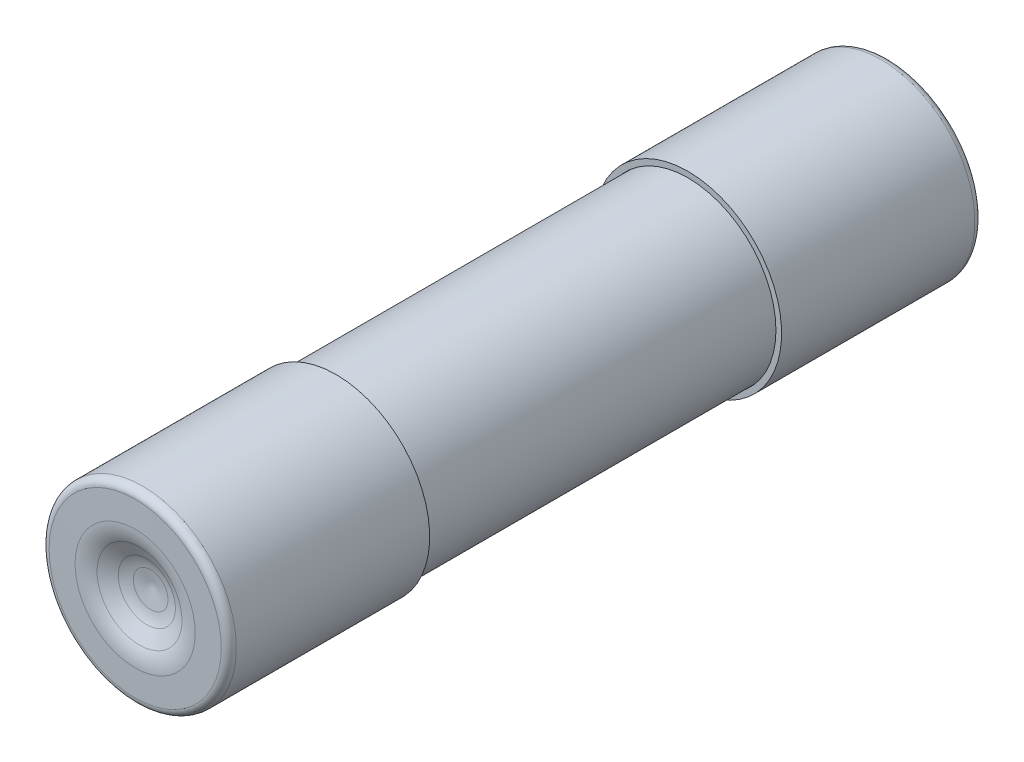
ISO-10303-21;
HEADER;
FILE_DESCRIPTION(('STEP AP214'),'2;1');
FILE_NAME('part.step','',(''),(''),'','','');
FILE_SCHEMA(('AUTOMOTIVE_DESIGN { 1 0 10303 214 1 1 1 1 }'));
ENDSEC;
DATA;
#1=APPLICATION_CONTEXT('core data for automotive mechanical design processes');
#2=APPLICATION_PROTOCOL_DEFINITION('international standard','automotive_design',2000,#1);
#3=PRODUCT_CONTEXT('',#1,'mechanical');
#4=PRODUCT('Part','Part','',(#3));
#5=PRODUCT_RELATED_PRODUCT_CATEGORY('part','',(#4));
#6=PRODUCT_DEFINITION_FORMATION('','',#4);
#7=PRODUCT_DEFINITION_CONTEXT('part definition',#1,'design');
#8=PRODUCT_DEFINITION('design','',#6,#7);
#9=PRODUCT_DEFINITION_SHAPE('','',#8);
#10=(LENGTH_UNIT() NAMED_UNIT(*) SI_UNIT(.MILLI.,.METRE.));
#11=(NAMED_UNIT(*) PLANE_ANGLE_UNIT() SI_UNIT($,.RADIAN.));
#12=(NAMED_UNIT(*) SI_UNIT($,.STERADIAN.) SOLID_ANGLE_UNIT());
#13=UNCERTAINTY_MEASURE_WITH_UNIT(LENGTH_MEASURE(1.E-05),#10,'distance_accuracy_value','');
#14=(GEOMETRIC_REPRESENTATION_CONTEXT(3) GLOBAL_UNCERTAINTY_ASSIGNED_CONTEXT((#13)) GLOBAL_UNIT_ASSIGNED_CONTEXT((#10,
#11,#12)) REPRESENTATION_CONTEXT('',''));
#15=CARTESIAN_POINT('',(0.,0.,0.));
#16=DIRECTION('',(0.,0.,1.));
#17=DIRECTION('',(1.,0.,0.));
#18=AXIS2_PLACEMENT_3D('',#15,#16,#17);
#19=CARTESIAN_POINT('',(0.,0.,19.3801475961462));
#20=DIRECTION('',(0.,0.,1.));
#21=DIRECTION('',(0.,-1.,0.));
#22=AXIS2_PLACEMENT_3D('',#19,#20,#21);
#23=DEGENERATE_TOROIDAL_SURFACE('',#22,0.0349351201433466,1.,.T.);
#24=CARTESIAN_POINT('',(0.,0.,18.3943292370881));
#25=DIRECTION('',(0.,0.,1.));
#26=DIRECTION('',(0.,-1.,0.));
#27=AXIS2_PLACEMENT_3D('',#24,#25,#26);
#28=CIRCLE('',#27,0.202750980371087);
#29=CARTESIAN_POINT('',(0.,-0.202750980371087,18.3943292370881));
#30=VERTEX_POINT('',#29);
#31=EDGE_CURVE('E12',#30,#30,#28,.T.);
#32=ORIENTED_EDGE('',*,*,#31,.F.);
#33=EDGE_LOOP('',(#32));
#34=FACE_BOUND('',#33,.T.);
#35=CARTESIAN_POINT('',(0.,0.,18.3801475961462));
#36=DIRECTION('',(0.,0.,1.));
#37=DIRECTION('',(0.,-1.,0.));
#38=AXIS2_PLACEMENT_3D('',#35,#36,#37);
#39=CIRCLE('',#38,0.0349351201433437);
#40=CARTESIAN_POINT('',(0.,-0.0349351201433436,18.3801475961462));
#41=VERTEX_POINT('',#40);
#42=EDGE_CURVE('E63',#41,#41,#39,.T.);
#43=ORIENTED_EDGE('',*,*,#42,.T.);
#44=EDGE_LOOP('',(#43));
#45=FACE_BOUND('',#44,.T.);
#46=ADVANCED_FACE('F43',(#34,#45),#23,.T.);
#47=CARTESIAN_POINT('',(0.,0.,18.3943292370881));
#48=DIRECTION('',(0.,0.,1.));
#49=DIRECTION('',(0.,-1.,0.));
#50=AXIS2_PLACEMENT_3D('',#47,#48,#49);
#51=CONICAL_SURFACE('',#50,0.202750980371087,1.40218263749149);
#52=CARTESIAN_POINT('',(0.,0.,18.4463330154933));
#53=DIRECTION('',(0.,0.,1.));
#54=DIRECTION('',(0.,-1.,0.));
#55=AXIS2_PLACEMENT_3D('',#52,#53,#54);
#56=CIRCLE('',#55,0.508242245753945);
#57=CARTESIAN_POINT('',(0.,-0.508242245753945,18.4463330154933));
#58=VERTEX_POINT('',#57);
#59=EDGE_CURVE('E49',#58,#58,#56,.T.);
#60=ORIENTED_EDGE('',*,*,#59,.F.);
#61=EDGE_LOOP('',(#60));
#62=FACE_BOUND('',#61,.T.);
#63=ORIENTED_EDGE('',*,*,#31,.T.);
#64=EDGE_LOOP('',(#63));
#65=FACE_BOUND('',#64,.T.);
#66=ADVANCED_FACE('F107',(#62,#65),#51,.T.);
#67=CARTESIAN_POINT('',(0.,0.,19.4321513745514));
#68=DIRECTION('',(0.,0.,1.));
#69=DIRECTION('',(0.,-1.,0.));
#70=AXIS2_PLACEMENT_3D('',#67,#68,#69);
#71=DEGENERATE_TOROIDAL_SURFACE('',#70,0.34042638552621,1.,.T.);
#72=CARTESIAN_POINT('',(0.,0.,18.5473246046598));
#73=DIRECTION('',(0.,0.,1.));
#74=DIRECTION('',(0.,-1.,0.));
#75=AXIS2_PLACEMENT_3D('',#72,#73,#74);
#76=CIRCLE('',#75,0.806346536714317);
#77=CARTESIAN_POINT('',(0.,-0.806346536714317,18.5473246046598));
#78=VERTEX_POINT('',#77);
#79=EDGE_CURVE('E100',#78,#78,#76,.T.);
#80=ORIENTED_EDGE('',*,*,#79,.F.);
#81=EDGE_LOOP('',(#80));
#82=FACE_BOUND('',#81,.T.);
#83=ORIENTED_EDGE('',*,*,#59,.T.);
#84=EDGE_LOOP('',(#83));
#85=FACE_BOUND('',#84,.T.);
#86=ADVANCED_FACE('F105',(#82,#85),#71,.T.);
#87=CARTESIAN_POINT('',(0.,0.,18.5473246046598));
#88=DIRECTION('',(0.,0.,1.));
#89=DIRECTION('',(0.,-1.,0.));
#90=AXIS2_PLACEMENT_3D('',#87,#88,#89);
#91=CONICAL_SURFACE('',#90,0.806346536714317,1.08612207754713);
#92=CARTESIAN_POINT('',(0.,0.,18.7348267698916));
#93=DIRECTION('',(0.,0.,1.));
#94=DIRECTION('',(0.,-1.,0.));
#95=AXIS2_PLACEMENT_3D('',#92,#93,#94);
#96=CIRCLE('',#95,1.16243101768532);
#97=CARTESIAN_POINT('',(0.,-1.16243101768532,18.7348267698916));
#98=VERTEX_POINT('',#97);
#99=EDGE_CURVE('E97',#98,#98,#96,.T.);
#100=ORIENTED_EDGE('',*,*,#99,.F.);
#101=EDGE_LOOP('',(#100));
#102=FACE_BOUND('',#101,.T.);
#103=ORIENTED_EDGE('',*,*,#79,.T.);
#104=EDGE_LOOP('',(#103));
#105=FACE_BOUND('',#104,.T.);
#106=ADVANCED_FACE('F162',(#102,#105),#91,.T.);
#107=CARTESIAN_POINT('',(0.,0.,17.85));
#108=DIRECTION('',(0.,0.,1.));
#109=DIRECTION('',(0.,-1.,0.));
#110=AXIS2_PLACEMENT_3D('',#107,#108,#109);
#111=TOROIDAL_SURFACE('',#110,1.62835116887342,0.999999999999997);
#112=CARTESIAN_POINT('',(0.,0.,18.85));
#113=DIRECTION('',(0.,0.,1.));
#114=DIRECTION('',(0.,-1.,0.));
#115=AXIS2_PLACEMENT_3D('',#112,#113,#114);
#116=CIRCLE('',#115,1.62835116887343);
#117=CARTESIAN_POINT('',(0.,-1.62835116887343,18.85));
#118=VERTEX_POINT('',#117);
#119=EDGE_CURVE('E94',#118,#118,#116,.T.);
#120=ORIENTED_EDGE('',*,*,#119,.F.);
#121=EDGE_LOOP('',(#120));
#122=FACE_BOUND('',#121,.T.);
#123=ORIENTED_EDGE('',*,*,#99,.T.);
#124=EDGE_LOOP('',(#123));
#125=FACE_BOUND('',#124,.T.);
#126=ADVANCED_FACE('F158',(#122,#125),#111,.F.);
#127=CARTESIAN_POINT('',(0.,2.285,18.85));
#128=DIRECTION('',(0.,0.,1.));
#129=DIRECTION('',(0.,-1.,0.));
#130=AXIS2_PLACEMENT_3D('',#127,#128,#129);
#131=PLANE('',#130);
#132=CARTESIAN_POINT('',(0.,0.,18.85));
#133=DIRECTION('',(0.,0.,1.));
#134=DIRECTION('',(0.,-1.,0.));
#135=AXIS2_PLACEMENT_3D('',#132,#133,#134);
#136=CIRCLE('',#135,2.285);
#137=CARTESIAN_POINT('',(0.,-2.285,18.85));
#138=VERTEX_POINT('',#137);
#139=EDGE_CURVE('E91',#138,#138,#136,.T.);
#140=ORIENTED_EDGE('',*,*,#139,.F.);
#141=EDGE_LOOP('',(#140));
#142=FACE_BOUND('',#141,.T.);
#143=ORIENTED_EDGE('',*,*,#119,.T.);
#144=EDGE_LOOP('',(#143));
#145=FACE_BOUND('',#144,.T.);
#146=ADVANCED_FACE('F154',(#142,#145),#131,.F.);
#147=CARTESIAN_POINT('',(0.,0.,18.8));
#148=DIRECTION('',(0.,0.,1.));
#149=DIRECTION('',(0.,-1.,0.));
#150=AXIS2_PLACEMENT_3D('',#147,#148,#149);
#151=TOROIDAL_SURFACE('',#150,2.285,0.049999999999999);
#152=CARTESIAN_POINT('',(0.,0.,18.8));
#153=DIRECTION('',(0.,0.,1.));
#154=DIRECTION('',(0.,-1.,0.));
#155=AXIS2_PLACEMENT_3D('',#152,#153,#154);
#156=CIRCLE('',#155,2.335);
#157=CARTESIAN_POINT('',(0.,-2.335,18.8));
#158=VERTEX_POINT('',#157);
#159=EDGE_CURVE('E88',#158,#158,#156,.T.);
#160=ORIENTED_EDGE('',*,*,#159,.F.);
#161=EDGE_LOOP('',(#160));
#162=FACE_BOUND('',#161,.T.);
#163=ORIENTED_EDGE('',*,*,#139,.T.);
#164=EDGE_LOOP('',(#163));
#165=FACE_BOUND('',#164,.T.);
#166=ADVANCED_FACE('F150',(#162,#165),#151,.F.);
#167=CARTESIAN_POINT('',(0.,0.,19.5807429338047));
#168=DIRECTION('',(0.,0.,1.));
#169=DIRECTION('',(0.,-1.,0.));
#170=AXIS2_PLACEMENT_3D('',#167,#168,#169);
#171=CYLINDRICAL_SURFACE('',#170,2.335);
#172=CARTESIAN_POINT('',(0.,0.,13.67));
#173=DIRECTION('',(0.,0.,1.));
#174=DIRECTION('',(0.,-1.,0.));
#175=AXIS2_PLACEMENT_3D('',#172,#173,#174);
#176=CIRCLE('',#175,2.335);
#177=CARTESIAN_POINT('',(0.,-2.335,13.67));
#178=VERTEX_POINT('',#177);
#179=EDGE_CURVE('E85',#178,#178,#176,.T.);
#180=ORIENTED_EDGE('',*,*,#179,.F.);
#181=EDGE_LOOP('',(#180));
#182=FACE_BOUND('',#181,.T.);
#183=ORIENTED_EDGE('',*,*,#159,.T.);
#184=EDGE_LOOP('',(#183));
#185=FACE_BOUND('',#184,.T.);
#186=ADVANCED_FACE('F146',(#182,#185),#171,.F.);
#187=CARTESIAN_POINT('',(0.,2.485,13.67));
#188=DIRECTION('',(0.,0.,1.));
#189=DIRECTION('',(0.,-1.,0.));
#190=AXIS2_PLACEMENT_3D('',#187,#188,#189);
#191=PLANE('',#190);
#192=CARTESIAN_POINT('',(0.,0.,13.67));
#193=DIRECTION('',(0.,0.,1.));
#194=DIRECTION('',(0.,-1.,0.));
#195=AXIS2_PLACEMENT_3D('',#192,#193,#194);
#196=CIRCLE('',#195,2.485);
#197=CARTESIAN_POINT('',(0.,-2.485,13.67));
#198=VERTEX_POINT('',#197);
#199=EDGE_CURVE('E82',#198,#198,#196,.T.);
#200=ORIENTED_EDGE('',*,*,#199,.F.);
#201=EDGE_LOOP('',(#200));
#202=FACE_BOUND('',#201,.T.);
#203=ORIENTED_EDGE('',*,*,#179,.T.);
#204=EDGE_LOOP('',(#203));
#205=FACE_BOUND('',#204,.T.);
#206=ADVANCED_FACE('F142',(#202,#205),#191,.F.);
#207=CARTESIAN_POINT('',(0.,0.,19.5807429338047));
#208=DIRECTION('',(0.,0.,1.));
#209=DIRECTION('',(0.,-1.,0.));
#210=AXIS2_PLACEMENT_3D('',#207,#208,#209);
#211=CYLINDRICAL_SURFACE('',#210,2.48499999999736);
#212=CARTESIAN_POINT('',(0.,0.,18.8));
#213=DIRECTION('',(0.,0.,1.));
#214=DIRECTION('',(0.,-1.,0.));
#215=AXIS2_PLACEMENT_3D('',#212,#213,#214);
#216=CIRCLE('',#215,2.48499999999471);
#217=CARTESIAN_POINT('',(0.,-2.48499999999471,18.8));
#218=VERTEX_POINT('',#217);
#219=EDGE_CURVE('E79',#218,#218,#216,.T.);
#220=ORIENTED_EDGE('',*,*,#219,.F.);
#221=EDGE_LOOP('',(#220));
#222=FACE_BOUND('',#221,.T.);
#223=ORIENTED_EDGE('',*,*,#199,.T.);
#224=EDGE_LOOP('',(#223));
#225=FACE_BOUND('',#224,.T.);
#226=ADVANCED_FACE('F138',(#222,#225),#211,.T.);
#227=CARTESIAN_POINT('',(0.,0.,18.8));
#228=DIRECTION('',(0.,0.,1.));
#229=DIRECTION('',(0.,-1.,0.));
#230=AXIS2_PLACEMENT_3D('',#227,#228,#229);
#231=TOROIDAL_SURFACE('',#230,2.285,0.199999999994713);
#232=CARTESIAN_POINT('',(0.,0.,18.9999997743625));
#233=DIRECTION('',(0.,0.,1.));
#234=DIRECTION('',(0.,-1.,0.));
#235=AXIS2_PLACEMENT_3D('',#232,#233,#234);
#236=CIRCLE('',#235,2.28530042459849);
#237=CARTESIAN_POINT('',(0.,-2.28530042459849,18.9999997743625));
#238=VERTEX_POINT('',#237);
#239=EDGE_CURVE('E76',#238,#238,#236,.T.);
#240=ORIENTED_EDGE('',*,*,#239,.F.);
#241=EDGE_LOOP('',(#240));
#242=FACE_BOUND('',#241,.T.);
#243=ORIENTED_EDGE('',*,*,#219,.T.);
#244=EDGE_LOOP('',(#243));
#245=FACE_BOUND('',#244,.T.);
#246=ADVANCED_FACE('F134',(#242,#245),#231,.T.);
#247=CARTESIAN_POINT('',(0.,0.,18.9999997743625));
#248=DIRECTION('',(0.,0.,-1.));
#249=DIRECTION('',(0.,1.,0.));
#250=AXIS2_PLACEMENT_3D('',#247,#248,#249);
#251=CONICAL_SURFACE('',#250,2.28530042459849,1.56929420318464);
#252=CARTESIAN_POINT('',(0.,0.,19.0010370737667));
#253=DIRECTION('',(0.,0.,1.));
#254=DIRECTION('',(0.,-1.,0.));
#255=AXIS2_PLACEMENT_3D('',#252,#253,#254);
#256=CIRCLE('',#255,1.59474565471326);
#257=CARTESIAN_POINT('',(0.,-1.59474565471326,19.0010370737667));
#258=VERTEX_POINT('',#257);
#259=EDGE_CURVE('E73',#258,#258,#256,.T.);
#260=ORIENTED_EDGE('',*,*,#259,.F.);
#261=EDGE_LOOP('',(#260));
#262=FACE_BOUND('',#261,.T.);
#263=ORIENTED_EDGE('',*,*,#239,.T.);
#264=EDGE_LOOP('',(#263));
#265=FACE_BOUND('',#264,.T.);
#266=ADVANCED_FACE('F130',(#262,#265),#251,.T.);
#267=CARTESIAN_POINT('',(0.,0.,18.0010382019542));
#268=DIRECTION('',(0.,0.,1.));
#269=DIRECTION('',(0.,-1.,0.));
#270=AXIS2_PLACEMENT_3D('',#267,#268,#269);
#271=TOROIDAL_SURFACE('',#270,1.5932435316679,1.);
#272=CARTESIAN_POINT('',(0.,0.,18.8858649718458));
#273=DIRECTION('',(0.,0.,1.));
#274=DIRECTION('',(0.,-1.,0.));
#275=AXIS2_PLACEMENT_3D('',#272,#273,#274);
#276=CIRCLE('',#275,1.1273233804798);
#277=CARTESIAN_POINT('',(0.,-1.1273233804798,18.8858649718458));
#278=VERTEX_POINT('',#277);
#279=EDGE_CURVE('E66',#278,#278,#276,.T.);
#280=ORIENTED_EDGE('',*,*,#279,.F.);
#281=EDGE_LOOP('',(#280));
#282=FACE_BOUND('',#281,.T.);
#283=ORIENTED_EDGE('',*,*,#259,.T.);
#284=EDGE_LOOP('',(#283));
#285=FACE_BOUND('',#284,.T.);
#286=ADVANCED_FACE('F126',(#282,#285),#271,.T.);
#287=CARTESIAN_POINT('',(0.,0.,18.8858649718458));
#288=DIRECTION('',(0.,0.,1.));
#289=DIRECTION('',(0.,-1.,0.));
#290=AXIS2_PLACEMENT_3D('',#287,#288,#289);
#291=CONICAL_SURFACE('',#290,1.1273233804798,1.08612207754713);
#292=CARTESIAN_POINT('',(0.,0.,18.6911859112977));
#293=DIRECTION('',(0.,0.,1.));
#294=DIRECTION('',(0.,-1.,0.));
#295=AXIS2_PLACEMENT_3D('',#292,#293,#294);
#296=CIRCLE('',#295,0.757609291335807);
#297=CARTESIAN_POINT('',(0.,-0.757609291335807,18.6911859112977));
#298=VERTEX_POINT('',#297);
#299=EDGE_CURVE('E62',#298,#298,#296,.T.);
#300=ORIENTED_EDGE('',*,*,#299,.F.);
#301=EDGE_LOOP('',(#300));
#302=FACE_BOUND('',#301,.T.);
#303=ORIENTED_EDGE('',*,*,#279,.T.);
#304=EDGE_LOOP('',(#303));
#305=FACE_BOUND('',#304,.T.);
#306=ADVANCED_FACE('F123',(#302,#305),#291,.F.);
#307=CARTESIAN_POINT('',(0.,0.,19.5760126811893));
#308=DIRECTION('',(0.,0.,1.));
#309=DIRECTION('',(0.,-1.,0.));
#310=AXIS2_PLACEMENT_3D('',#307,#308,#309);
#311=DEGENERATE_TOROIDAL_SURFACE('',#310,0.291689140147699,1.,.T.);
#312=CARTESIAN_POINT('',(0.,0.,18.5901943221312));
#313=DIRECTION('',(0.,0.,1.));
#314=DIRECTION('',(0.,-1.,0.));
#315=AXIS2_PLACEMENT_3D('',#312,#313,#314);
#316=CIRCLE('',#315,0.459505000375436);
#317=CARTESIAN_POINT('',(0.,-0.459505000375436,18.5901943221312));
#318=VERTEX_POINT('',#317);
#319=EDGE_CURVE('E60',#318,#318,#316,.T.);
#320=ORIENTED_EDGE('',*,*,#319,.F.);
#321=EDGE_LOOP('',(#320));
#322=FACE_BOUND('',#321,.T.);
#323=ORIENTED_EDGE('',*,*,#299,.T.);
#324=EDGE_LOOP('',(#323));
#325=FACE_BOUND('',#324,.T.);
#326=ADVANCED_FACE('F56',(#322,#325),#311,.F.);
#327=CARTESIAN_POINT('',(0.,0.,18.5901943221312));
#328=DIRECTION('',(0.,0.,1.));
#329=DIRECTION('',(0.,-1.,0.));
#330=AXIS2_PLACEMENT_3D('',#327,#328,#329);
#331=CONICAL_SURFACE('',#330,0.459505000375436,1.40218263749149);
#332=CARTESIAN_POINT('',(0.,0.,18.5119727854673));
#333=VERTEX_POINT('',#332);
#334=VERTEX_LOOP('',#333);
#335=FACE_BOUND('',#334,.T.);
#336=ORIENTED_EDGE('',*,*,#319,.T.);
#337=EDGE_LOOP('',(#336));
#338=FACE_BOUND('',#337,.T.);
#339=ADVANCED_FACE('F52',(#335,#338),#331,.F.);
#340=CARTESIAN_POINT('',(0.,0.,18.3801475961462));
#341=DIRECTION('',(0.,0.,1.));
#342=DIRECTION('',(0.,-1.,0.));
#343=AXIS2_PLACEMENT_3D('',#340,#341,#342);
#344=PLANE('',#343);
#345=ORIENTED_EDGE('',*,*,#42,.F.);
#346=EDGE_LOOP('',(#345));
#347=FACE_BOUND('',#346,.T.);
#348=ADVANCED_FACE('F55',(#347),#344,.F.);
#349=CLOSED_SHELL('',(#46,#66,#86,#106,#126,#146,#166,#186,#206,#226,#246,#266,#286,#306,#326,
#339,#348));
#350=MANIFOLD_SOLID_BREP('B2',#349);
#351=CARTESIAN_POINT('',(0.,2.485,4.33));
#352=DIRECTION('',(0.,0.,-1.));
#353=DIRECTION('',(0.,1.,0.));
#354=AXIS2_PLACEMENT_3D('',#351,#352,#353);
#355=PLANE('',#354);
#356=CARTESIAN_POINT('',(0.,0.,4.33));
#357=DIRECTION('',(0.,0.,1.));
#358=DIRECTION('',(0.,-1.,0.));
#359=AXIS2_PLACEMENT_3D('',#356,#357,#358);
#360=CIRCLE('',#359,2.335);
#361=CARTESIAN_POINT('',(0.,-2.335,4.33));
#362=VERTEX_POINT('',#361);
#363=EDGE_CURVE('E339',#362,#362,#360,.T.);
#364=ORIENTED_EDGE('',*,*,#363,.F.);
#365=EDGE_LOOP('',(#364));
#366=FACE_BOUND('',#365,.T.);
#367=CARTESIAN_POINT('',(0.,0.,4.33));
#368=DIRECTION('',(0.,0.,1.));
#369=DIRECTION('',(0.,-1.,0.));
#370=AXIS2_PLACEMENT_3D('',#367,#368,#369);
#371=CIRCLE('',#370,2.485);
#372=CARTESIAN_POINT('',(0.,-2.485,4.33));
#373=VERTEX_POINT('',#372);
#374=EDGE_CURVE('E41',#373,#373,#371,.T.);
#375=ORIENTED_EDGE('',*,*,#374,.T.);
#376=EDGE_LOOP('',(#375));
#377=FACE_BOUND('',#376,.T.);
#378=ADVANCED_FACE('F302',(#366,#377),#355,.F.);
#379=CARTESIAN_POINT('',(0.,0.,19.5807429338047));
#380=DIRECTION('',(0.,0.,1.));
#381=DIRECTION('',(0.,-1.,0.));
#382=AXIS2_PLACEMENT_3D('',#379,#380,#381);
#383=CYLINDRICAL_SURFACE('',#382,2.48499999999472);
#384=ORIENTED_EDGE('',*,*,#374,.F.);
#385=EDGE_LOOP('',(#384));
#386=FACE_BOUND('',#385,.T.);
#387=CARTESIAN_POINT('',(0.,0.,-0.799999999999995));
#388=DIRECTION('',(0.,0.,1.));
#389=DIRECTION('',(0.,-1.,0.));
#390=AXIS2_PLACEMENT_3D('',#387,#388,#389);
#391=CIRCLE('',#390,2.48499999998944);
#392=CARTESIAN_POINT('',(0.,-2.48499999998944,-0.799999999999995));
#393=VERTEX_POINT('',#392);
#394=EDGE_CURVE('E308',#393,#393,#391,.T.);
#395=ORIENTED_EDGE('',*,*,#394,.T.);
#396=EDGE_LOOP('',(#395));
#397=FACE_BOUND('',#396,.T.);
#398=ADVANCED_FACE('F329',(#386,#397),#383,.T.);
#399=CARTESIAN_POINT('',(0.,0.,-0.799999999999984));
#400=DIRECTION('',(0.,0.,1.));
#401=DIRECTION('',(0.,-1.,0.));
#402=AXIS2_PLACEMENT_3D('',#399,#400,#401);
#403=TOROIDAL_SURFACE('',#402,2.285,0.199999999994721);
#404=ORIENTED_EDGE('',*,*,#394,.F.);
#405=EDGE_LOOP('',(#404));
#406=FACE_BOUND('',#405,.T.);
#407=CARTESIAN_POINT('',(0.,0.,-0.999999774357229));
#408=DIRECTION('',(0.,0.,1.));
#409=DIRECTION('',(0.,-1.,0.));
#410=AXIS2_PLACEMENT_3D('',#407,#408,#409);
#411=CIRCLE('',#410,2.28530042459848);
#412=CARTESIAN_POINT('',(0.,-2.28530042459848,-0.999999774357229));
#413=VERTEX_POINT('',#412);
#414=EDGE_CURVE('E345',#413,#413,#411,.T.);
#415=ORIENTED_EDGE('',*,*,#414,.T.);
#416=EDGE_LOOP('',(#415));
#417=FACE_BOUND('',#416,.T.);
#418=ADVANCED_FACE('F334',(#406,#417),#403,.T.);
#419=CARTESIAN_POINT('',(0.,0.,-1.00103707376671));
#420=DIRECTION('',(0.,0.,1.));
#421=DIRECTION('',(0.,-1.,0.));
#422=AXIS2_PLACEMENT_3D('',#419,#420,#421);
#423=CONICAL_SURFACE('',#422,1.59474565471325,1.56929420317699);
#424=ORIENTED_EDGE('',*,*,#414,.F.);
#425=EDGE_LOOP('',(#424));
#426=FACE_BOUND('',#425,.T.);
#427=CARTESIAN_POINT('',(0.,0.,-1.00103707376671));
#428=DIRECTION('',(0.,0.,1.));
#429=DIRECTION('',(0.,-1.,0.));
#430=AXIS2_PLACEMENT_3D('',#427,#428,#429);
#431=CIRCLE('',#430,1.59474565471325);
#432=CARTESIAN_POINT('',(0.,-1.59474565471325,-1.00103707376671));
#433=VERTEX_POINT('',#432);
#434=EDGE_CURVE('E347',#433,#433,#431,.T.);
#435=ORIENTED_EDGE('',*,*,#434,.T.);
#436=EDGE_LOOP('',(#435));
#437=FACE_BOUND('',#436,.T.);
#438=ADVANCED_FACE('F539',(#426,#437),#423,.T.);
#439=CARTESIAN_POINT('',(0.,0.,-0.0010382019541694));
#440=DIRECTION('',(0.,0.,1.));
#441=DIRECTION('',(0.,-1.,0.));
#442=AXIS2_PLACEMENT_3D('',#439,#440,#441);
#443=TOROIDAL_SURFACE('',#442,1.5932435316679,1.);
#444=ORIENTED_EDGE('',*,*,#434,.F.);
#445=EDGE_LOOP('',(#444));
#446=FACE_BOUND('',#445,.T.);
#447=CARTESIAN_POINT('',(0.,0.,-0.885864971845798));
#448=DIRECTION('',(0.,0.,1.));
#449=DIRECTION('',(0.,-1.,0.));
#450=AXIS2_PLACEMENT_3D('',#447,#448,#449);
#451=CIRCLE('',#450,1.12732338047979);
#452=CARTESIAN_POINT('',(0.,-1.12732338047979,-0.885864971845798));
#453=VERTEX_POINT('',#452);
#454=EDGE_CURVE('E352',#453,#453,#451,.T.);
#455=ORIENTED_EDGE('',*,*,#454,.T.);
#456=EDGE_LOOP('',(#455));
#457=FACE_BOUND('',#456,.T.);
#458=ADVANCED_FACE('F530',(#446,#457),#443,.T.);
#459=CARTESIAN_POINT('',(0.,0.,-0.691185911297666));
#460=DIRECTION('',(0.,0.,-1.));
#461=DIRECTION('',(0.,1.,0.));
#462=AXIS2_PLACEMENT_3D('',#459,#460,#461);
#463=CONICAL_SURFACE('',#462,0.757609291335803,1.08612207754713);
#464=ORIENTED_EDGE('',*,*,#454,.F.);
#465=EDGE_LOOP('',(#464));
#466=FACE_BOUND('',#465,.T.);
#467=CARTESIAN_POINT('',(0.,0.,-0.691185911297666));
#468=DIRECTION('',(0.,0.,1.));
#469=DIRECTION('',(0.,-1.,0.));
#470=AXIS2_PLACEMENT_3D('',#467,#468,#469);
#471=CIRCLE('',#470,0.757609291335803);
#472=CARTESIAN_POINT('',(0.,-0.757609291335801,-0.691185911297666));
#473=VERTEX_POINT('',#472);
#474=EDGE_CURVE('E355',#473,#473,#471,.T.);
#475=ORIENTED_EDGE('',*,*,#474,.T.);
#476=EDGE_LOOP('',(#475));
#477=FACE_BOUND('',#476,.T.);
#478=ADVANCED_FACE('F324',(#466,#477),#463,.F.);
#479=CARTESIAN_POINT('',(0.,0.,-1.57601268118929));
#480=DIRECTION('',(0.,0.,1.));
#481=DIRECTION('',(0.,-1.,0.));
#482=AXIS2_PLACEMENT_3D('',#479,#480,#481);
#483=DEGENERATE_TOROIDAL_SURFACE('',#482,0.291689140147695,1.,.T.);
#484=ORIENTED_EDGE('',*,*,#474,.F.);
#485=EDGE_LOOP('',(#484));
#486=FACE_BOUND('',#485,.T.);
#487=CARTESIAN_POINT('',(0.,0.,-0.590194322131182));
#488=DIRECTION('',(0.,0.,1.));
#489=DIRECTION('',(0.,-1.,0.));
#490=AXIS2_PLACEMENT_3D('',#487,#488,#489);
#491=CIRCLE('',#490,0.459505000375433);
#492=CARTESIAN_POINT('',(0.,-0.459505000375431,-0.590194322131182));
#493=VERTEX_POINT('',#492);
#494=EDGE_CURVE('E358',#493,#493,#491,.T.);
#495=ORIENTED_EDGE('',*,*,#494,.T.);
#496=EDGE_LOOP('',(#495));
#497=FACE_BOUND('',#496,.T.);
#498=ADVANCED_FACE('F314',(#486,#497),#483,.F.);
#499=CARTESIAN_POINT('',(0.,0.,-0.51197278546734));
#500=DIRECTION('',(0.,0.,-1.));
#501=DIRECTION('',(0.,1.,0.));
#502=AXIS2_PLACEMENT_3D('',#499,#500,#501);
#503=CONICAL_SURFACE('',#502,0.,1.40218263749148);
#504=ORIENTED_EDGE('',*,*,#494,.F.);
#505=EDGE_LOOP('',(#504));
#506=FACE_BOUND('',#505,.T.);
#507=CARTESIAN_POINT('',(0.,0.,-0.511972785467341));
#508=VERTEX_POINT('',#507);
#509=VERTEX_LOOP('',#508);
#510=FACE_BOUND('',#509,.T.);
#511=ADVANCED_FACE('F311',(#506,#510),#503,.F.);
#512=CARTESIAN_POINT('',(0.,0.,-1.3801475961462));
#513=DIRECTION('',(0.,0.,1.));
#514=DIRECTION('',(0.,-1.,0.));
#515=AXIS2_PLACEMENT_3D('',#512,#513,#514);
#516=DEGENERATE_TOROIDAL_SURFACE('',#515,0.0349351201433415,1.,.T.);
#517=CARTESIAN_POINT('',(0.,0.,-0.380147596146196));
#518=DIRECTION('',(0.,0.,1.));
#519=DIRECTION('',(0.,-1.,0.));
#520=AXIS2_PLACEMENT_3D('',#517,#518,#519);
#521=CIRCLE('',#520,0.0349351201433387);
#522=CARTESIAN_POINT('',(0.,-0.0349351201433371,-0.380147596146196));
#523=VERTEX_POINT('',#522);
#524=EDGE_CURVE('E361',#523,#523,#521,.T.);
#525=ORIENTED_EDGE('',*,*,#524,.F.);
#526=EDGE_LOOP('',(#525));
#527=FACE_BOUND('',#526,.T.);
#528=CARTESIAN_POINT('',(0.,0.,-0.394329237088088));
#529=DIRECTION('',(0.,0.,1.));
#530=DIRECTION('',(0.,-1.,0.));
#531=AXIS2_PLACEMENT_3D('',#528,#529,#530);
#532=CIRCLE('',#531,0.202750980371084);
#533=CARTESIAN_POINT('',(0.,-0.202750980371082,-0.394329237088088));
#534=VERTEX_POINT('',#533);
#535=EDGE_CURVE('E364',#534,#534,#532,.T.);
#536=ORIENTED_EDGE('',*,*,#535,.T.);
#537=EDGE_LOOP('',(#536));
#538=FACE_BOUND('',#537,.T.);
#539=ADVANCED_FACE('F313',(#527,#538),#516,.T.);
#540=CARTESIAN_POINT('',(0.,0.,-0.446333015493339));
#541=DIRECTION('',(0.,0.,-1.));
#542=DIRECTION('',(0.,1.,0.));
#543=AXIS2_PLACEMENT_3D('',#540,#541,#542);
#544=CONICAL_SURFACE('',#543,0.508242245753942,1.40218263749148);
#545=ORIENTED_EDGE('',*,*,#535,.F.);
#546=EDGE_LOOP('',(#545));
#547=FACE_BOUND('',#546,.T.);
#548=CARTESIAN_POINT('',(0.,0.,-0.446333015493339));
#549=DIRECTION('',(0.,0.,1.));
#550=DIRECTION('',(0.,-1.,0.));
#551=AXIS2_PLACEMENT_3D('',#548,#549,#550);
#552=CIRCLE('',#551,0.508242245753942);
#553=CARTESIAN_POINT('',(0.,-0.508242245753941,-0.446333015493339));
#554=VERTEX_POINT('',#553);
#555=EDGE_CURVE('E367',#554,#554,#552,.T.);
#556=ORIENTED_EDGE('',*,*,#555,.T.);
#557=EDGE_LOOP('',(#556));
#558=FACE_BOUND('',#557,.T.);
#559=ADVANCED_FACE('F321',(#547,#558),#544,.T.);
#560=CARTESIAN_POINT('',(0.,0.,-1.43215137455145));
#561=DIRECTION('',(0.,0.,1.));
#562=DIRECTION('',(0.,-1.,0.));
#563=AXIS2_PLACEMENT_3D('',#560,#561,#562);
#564=DEGENERATE_TOROIDAL_SURFACE('',#563,0.340426385526207,1.,.T.);
#565=ORIENTED_EDGE('',*,*,#555,.F.);
#566=EDGE_LOOP('',(#565));
#567=FACE_BOUND('',#566,.T.);
#568=CARTESIAN_POINT('',(0.,0.,-0.547324604659821));
#569=DIRECTION('',(0.,0.,1.));
#570=DIRECTION('',(0.,-1.,0.));
#571=AXIS2_PLACEMENT_3D('',#568,#569,#570);
#572=CIRCLE('',#571,0.806346536714314);
#573=CARTESIAN_POINT('',(0.,-0.806346536714313,-0.547324604659821));
#574=VERTEX_POINT('',#573);
#575=EDGE_CURVE('E370',#574,#574,#572,.T.);
#576=ORIENTED_EDGE('',*,*,#575,.T.);
#577=EDGE_LOOP('',(#576));
#578=FACE_BOUND('',#577,.T.);
#579=ADVANCED_FACE('F429',(#567,#578),#564,.T.);
#580=CARTESIAN_POINT('',(0.,0.,-0.734826769891627));
#581=DIRECTION('',(0.,0.,-1.));
#582=DIRECTION('',(0.,1.,0.));
#583=AXIS2_PLACEMENT_3D('',#580,#581,#582);
#584=CONICAL_SURFACE('',#583,1.16243101768531,1.08612207754713);
#585=ORIENTED_EDGE('',*,*,#575,.F.);
#586=EDGE_LOOP('',(#585));
#587=FACE_BOUND('',#586,.T.);
#588=CARTESIAN_POINT('',(0.,0.,-0.734826769891627));
#589=DIRECTION('',(0.,0.,1.));
#590=DIRECTION('',(0.,-1.,0.));
#591=AXIS2_PLACEMENT_3D('',#588,#589,#590);
#592=CIRCLE('',#591,1.16243101768531);
#593=CARTESIAN_POINT('',(0.,-1.16243101768531,-0.734826769891627));
#594=VERTEX_POINT('',#593);
#595=EDGE_CURVE('E373',#594,#594,#592,.T.);
#596=ORIENTED_EDGE('',*,*,#595,.T.);
#597=EDGE_LOOP('',(#596));
#598=FACE_BOUND('',#597,.T.);
#599=ADVANCED_FACE('F425',(#587,#598),#584,.T.);
#600=CARTESIAN_POINT('',(0.,0.,0.15));
#601=DIRECTION('',(0.,0.,1.));
#602=DIRECTION('',(0.,-1.,0.));
#603=AXIS2_PLACEMENT_3D('',#600,#601,#602);
#604=TOROIDAL_SURFACE('',#603,1.62835116887342,1.);
#605=ORIENTED_EDGE('',*,*,#595,.F.);
#606=EDGE_LOOP('',(#605));
#607=FACE_BOUND('',#606,.T.);
#608=CARTESIAN_POINT('',(0.,0.,-0.85));
#609=DIRECTION('',(0.,0.,1.));
#610=DIRECTION('',(0.,-1.,0.));
#611=AXIS2_PLACEMENT_3D('',#608,#609,#610);
#612=CIRCLE('',#611,1.62835116887342);
#613=CARTESIAN_POINT('',(0.,-1.62835116887342,-0.85));
#614=VERTEX_POINT('',#613);
#615=EDGE_CURVE('E376',#614,#614,#612,.T.);
#616=ORIENTED_EDGE('',*,*,#615,.T.);
#617=EDGE_LOOP('',(#616));
#618=FACE_BOUND('',#617,.T.);
#619=ADVANCED_FACE('F421',(#607,#618),#604,.F.);
#620=CARTESIAN_POINT('',(0.,2.285,-0.85));
#621=DIRECTION('',(0.,0.,-1.));
#622=DIRECTION('',(0.,1.,0.));
#623=AXIS2_PLACEMENT_3D('',#620,#621,#622);
#624=PLANE('',#623);
#625=ORIENTED_EDGE('',*,*,#615,.F.);
#626=EDGE_LOOP('',(#625));
#627=FACE_BOUND('',#626,.T.);
#628=CARTESIAN_POINT('',(0.,0.,-0.85));
#629=DIRECTION('',(0.,0.,1.));
#630=DIRECTION('',(0.,-1.,0.));
#631=AXIS2_PLACEMENT_3D('',#628,#629,#630);
#632=CIRCLE('',#631,2.285);
#633=CARTESIAN_POINT('',(0.,-2.285,-0.85));
#634=VERTEX_POINT('',#633);
#635=EDGE_CURVE('E379',#634,#634,#632,.T.);
#636=ORIENTED_EDGE('',*,*,#635,.T.);
#637=EDGE_LOOP('',(#636));
#638=FACE_BOUND('',#637,.T.);
#639=ADVANCED_FACE('F417',(#627,#638),#624,.F.);
#640=CARTESIAN_POINT('',(0.,0.,-0.8));
#641=DIRECTION('',(0.,0.,1.));
#642=DIRECTION('',(0.,-1.,0.));
#643=AXIS2_PLACEMENT_3D('',#640,#641,#642);
#644=TOROIDAL_SURFACE('',#643,2.285,0.0500000000000001);
#645=ORIENTED_EDGE('',*,*,#635,.F.);
#646=EDGE_LOOP('',(#645));
#647=FACE_BOUND('',#646,.T.);
#648=CARTESIAN_POINT('',(0.,0.,-0.799999999999999));
#649=DIRECTION('',(0.,0.,1.));
#650=DIRECTION('',(0.,-1.,0.));
#651=AXIS2_PLACEMENT_3D('',#648,#649,#650);
#652=CIRCLE('',#651,2.335);
#653=CARTESIAN_POINT('',(0.,-2.335,-0.799999999999999));
#654=VERTEX_POINT('',#653);
#655=EDGE_CURVE('E382',#654,#654,#652,.T.);
#656=ORIENTED_EDGE('',*,*,#655,.T.);
#657=EDGE_LOOP('',(#656));
#658=FACE_BOUND('',#657,.T.);
#659=ADVANCED_FACE('F413',(#647,#658),#644,.F.);
#660=CARTESIAN_POINT('',(0.,0.,19.5807429338047));
#661=DIRECTION('',(0.,0.,1.));
#662=DIRECTION('',(0.,-1.,0.));
#663=AXIS2_PLACEMENT_3D('',#660,#661,#662);
#664=CYLINDRICAL_SURFACE('',#663,2.335);
#665=ORIENTED_EDGE('',*,*,#655,.F.);
#666=EDGE_LOOP('',(#665));
#667=FACE_BOUND('',#666,.T.);
#668=ORIENTED_EDGE('',*,*,#363,.T.);
#669=EDGE_LOOP('',(#668));
#670=FACE_BOUND('',#669,.T.);
#671=ADVANCED_FACE('F398',(#667,#670),#664,.F.);
#672=CARTESIAN_POINT('',(0.,-0.0349351201433371,18.4198524038538));
#673=DIRECTION('',(0.,0.,-1.));
#674=DIRECTION('',(-1.,0.,0.));
#675=AXIS2_PLACEMENT_3D('',#672,#673,#674);
#676=CYLINDRICAL_SURFACE('',#675,0.0972307246769333);
#677=CARTESIAN_POINT('',(0.,-0.0349351201433371,18.4198524038538));
#678=DIRECTION('',(0.,0.,1.));
#679=DIRECTION('',(1.,0.,0.));
#680=AXIS2_PLACEMENT_3D('',#677,#678,#679);
#681=CIRCLE('',#680,0.0972307246769333);
#682=CARTESIAN_POINT('',(0.0972307246769333,-0.0349351201433371,18.4198524038538));
#683=VERTEX_POINT('',#682);
#684=EDGE_CURVE('E386',#683,#683,#681,.T.);
#685=ORIENTED_EDGE('',*,*,#684,.F.);
#686=EDGE_LOOP('',(#685));
#687=FACE_BOUND('',#686,.T.);
#688=CARTESIAN_POINT('',(0.,-0.0349351201433371,-0.380147596146197));
#689=DIRECTION('',(0.,0.,1.));
#690=DIRECTION('',(1.,0.,0.));
#691=AXIS2_PLACEMENT_3D('',#688,#689,#690);
#692=CIRCLE('',#691,0.0972307246769333);
#693=CARTESIAN_POINT('',(0.0972307246769333,-0.0349351201433371,-0.380147596146197));
#694=VERTEX_POINT('',#693);
#695=EDGE_CURVE('E387',#694,#694,#692,.T.);
#696=ORIENTED_EDGE('',*,*,#695,.T.);
#697=EDGE_LOOP('',(#696));
#698=FACE_BOUND('',#697,.T.);
#699=ADVANCED_FACE('F395',(#687,#698),#676,.T.);
#700=CARTESIAN_POINT('',(0.,-0.0349351201433371,18.4198524038538));
#701=DIRECTION('',(0.,0.,1.));
#702=DIRECTION('',(1.,0.,0.));
#703=AXIS2_PLACEMENT_3D('',#700,#701,#702);
#704=PLANE('',#703);
#705=ORIENTED_EDGE('',*,*,#684,.T.);
#706=EDGE_LOOP('',(#705));
#707=FACE_BOUND('',#706,.T.);
#708=ADVANCED_FACE('F393',(#707),#704,.T.);
#709=CARTESIAN_POINT('',(0.,-0.0349351201433371,-0.380147596146197));
#710=DIRECTION('',(0.,0.,1.));
#711=DIRECTION('',(1.,0.,0.));
#712=AXIS2_PLACEMENT_3D('',#709,#710,#711);
#713=PLANE('',#712);
#714=ORIENTED_EDGE('',*,*,#524,.T.);
#715=EDGE_LOOP('',(#714));
#716=FACE_BOUND('',#715,.T.);
#717=ORIENTED_EDGE('',*,*,#695,.F.);
#718=EDGE_LOOP('',(#717));
#719=FACE_BOUND('',#718,.T.);
#720=ADVANCED_FACE('F402',(#716,#719),#713,.F.);
#721=CLOSED_SHELL('',(#378,#398,#418,#438,#458,#478,#498,#511,#539,#559,#579,#599,#619,#639,
#659,#671,#699,#708,#720));
#722=MANIFOLD_SOLID_BREP('B6',#721);
#723=CARTESIAN_POINT('',(0.,0.,18.));
#724=DIRECTION('',(0.,0.,1.));
#725=DIRECTION('',(1.,0.,0.));
#726=AXIS2_PLACEMENT_3D('',#723,#724,#725);
#727=PLANE('',#726);
#728=CARTESIAN_POINT('',(0.,0.,18.));
#729=DIRECTION('',(0.,0.,1.));
#730=DIRECTION('',(1.,0.,0.));
#731=AXIS2_PLACEMENT_3D('',#728,#729,#730);
#732=CIRCLE('',#731,2.33);
#733=CARTESIAN_POINT('',(2.33,0.,18.));
#734=VERTEX_POINT('',#733);
#735=EDGE_CURVE('E301',#734,#734,#732,.T.);
#736=ORIENTED_EDGE('',*,*,#735,.T.);
#737=EDGE_LOOP('',(#736));
#738=FACE_BOUND('',#737,.T.);
#739=CARTESIAN_POINT('',(0.,0.,18.));
#740=DIRECTION('',(0.,0.,1.));
#741=DIRECTION('',(1.,0.,0.));
#742=AXIS2_PLACEMENT_3D('',#739,#740,#741);
#743=CIRCLE('',#742,2.08);
#744=CARTESIAN_POINT('',(2.08,0.,18.));
#745=VERTEX_POINT('',#744);
#746=EDGE_CURVE('E595',#745,#745,#743,.T.);
#747=ORIENTED_EDGE('',*,*,#746,.F.);
#748=EDGE_LOOP('',(#747));
#749=FACE_BOUND('',#748,.T.);
#750=ADVANCED_FACE('F584',(#738,#749),#727,.T.);
#751=CARTESIAN_POINT('',(0.,0.,0.));
#752=DIRECTION('',(0.,0.,1.));
#753=DIRECTION('',(1.,0.,0.));
#754=AXIS2_PLACEMENT_3D('',#751,#752,#753);
#755=PLANE('',#754);
#756=CARTESIAN_POINT('',(0.,0.,0.));
#757=DIRECTION('',(0.,0.,1.));
#758=DIRECTION('',(1.,0.,0.));
#759=AXIS2_PLACEMENT_3D('',#756,#757,#758);
#760=CIRCLE('',#759,2.33);
#761=CARTESIAN_POINT('',(2.33,0.,0.));
#762=VERTEX_POINT('',#761);
#763=EDGE_CURVE('E588',#762,#762,#760,.T.);
#764=ORIENTED_EDGE('',*,*,#763,.F.);
#765=EDGE_LOOP('',(#764));
#766=FACE_BOUND('',#765,.T.);
#767=CARTESIAN_POINT('',(0.,0.,0.));
#768=DIRECTION('',(0.,0.,1.));
#769=DIRECTION('',(1.,0.,0.));
#770=AXIS2_PLACEMENT_3D('',#767,#768,#769);
#771=CIRCLE('',#770,2.08);
#772=CARTESIAN_POINT('',(2.08,0.,0.));
#773=VERTEX_POINT('',#772);
#774=EDGE_CURVE('E597',#773,#773,#771,.T.);
#775=ORIENTED_EDGE('',*,*,#774,.T.);
#776=EDGE_LOOP('',(#775));
#777=FACE_BOUND('',#776,.T.);
#778=ADVANCED_FACE('F607',(#766,#777),#755,.F.);
#779=CARTESIAN_POINT('',(0.,0.,18.));
#780=DIRECTION('',(0.,0.,-1.));
#781=DIRECTION('',(-1.,0.,0.));
#782=AXIS2_PLACEMENT_3D('',#779,#780,#781);
#783=CYLINDRICAL_SURFACE('',#782,2.33);
#784=ORIENTED_EDGE('',*,*,#735,.F.);
#785=EDGE_LOOP('',(#784));
#786=FACE_BOUND('',#785,.T.);
#787=ORIENTED_EDGE('',*,*,#763,.T.);
#788=EDGE_LOOP('',(#787));
#789=FACE_BOUND('',#788,.T.);
#790=ADVANCED_FACE('F586',(#786,#789),#783,.T.);
#791=CARTESIAN_POINT('',(0.,0.,18.));
#792=DIRECTION('',(0.,0.,-1.));
#793=DIRECTION('',(-1.,0.,0.));
#794=AXIS2_PLACEMENT_3D('',#791,#792,#793);
#795=CYLINDRICAL_SURFACE('',#794,2.08);
#796=ORIENTED_EDGE('',*,*,#746,.T.);
#797=EDGE_LOOP('',(#796));
#798=FACE_BOUND('',#797,.T.);
#799=ORIENTED_EDGE('',*,*,#774,.F.);
#800=EDGE_LOOP('',(#799));
#801=FACE_BOUND('',#800,.T.);
#802=ADVANCED_FACE('F603',(#798,#801),#795,.F.);
#803=CLOSED_SHELL('',(#750,#778,#790,#802));
#804=MANIFOLD_SOLID_BREP('B35',#803);
#805=ADVANCED_BREP_SHAPE_REPRESENTATION('',(#18,#350,#722,#804),#14);
#806=SHAPE_DEFINITION_REPRESENTATION(#9,#805);
ENDSEC;
END-ISO-10303-21;
